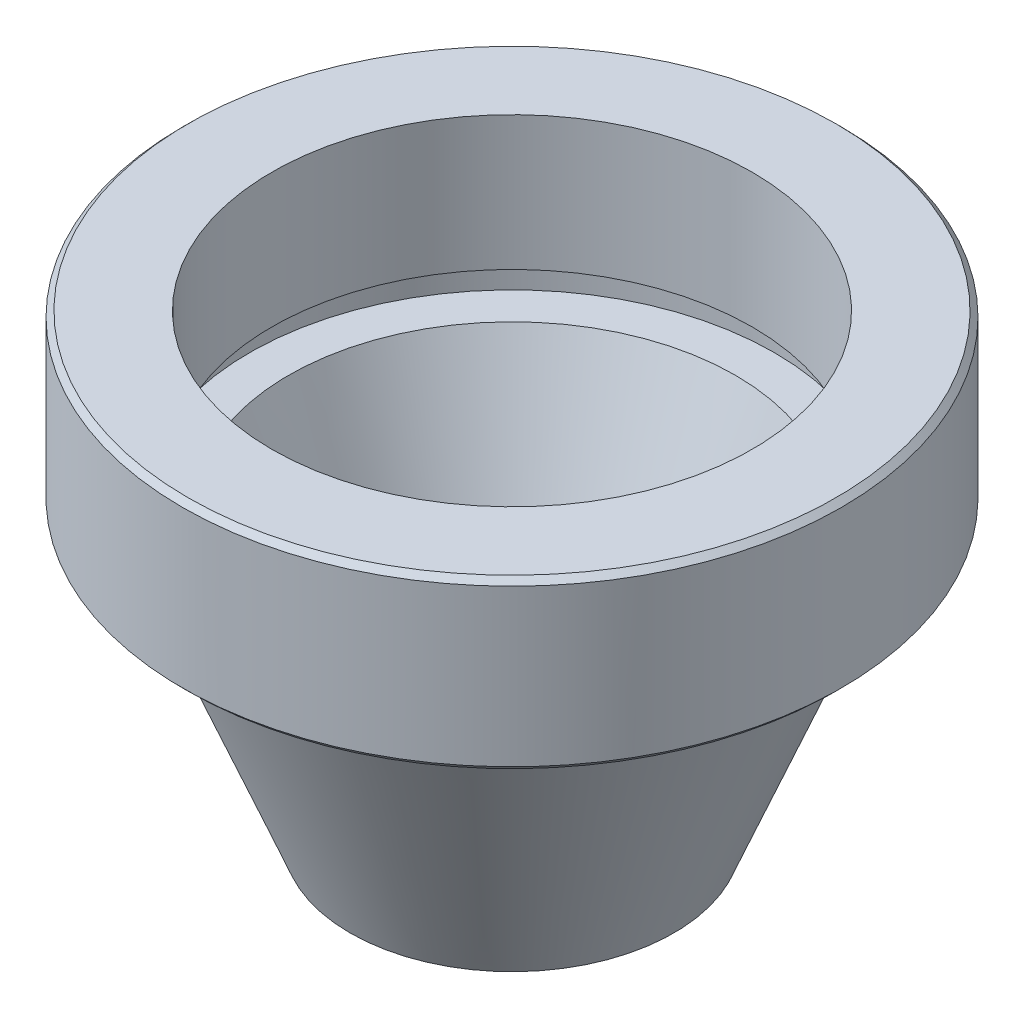
ISO-10303-21;
HEADER;
FILE_DESCRIPTION(('STEP AP214'),'2;1');
FILE_NAME('part.step','',(''),(''),'','','');
FILE_SCHEMA(('AUTOMOTIVE_DESIGN { 1 0 10303 214 1 1 1 1 }'));
ENDSEC;
DATA;
#1=APPLICATION_CONTEXT('core data for automotive mechanical design processes');
#2=APPLICATION_PROTOCOL_DEFINITION('international standard','automotive_design',2000,#1);
#3=PRODUCT_CONTEXT('',#1,'mechanical');
#4=PRODUCT('Part','Part','',(#3));
#5=PRODUCT_RELATED_PRODUCT_CATEGORY('part','',(#4));
#6=PRODUCT_DEFINITION_FORMATION('','',#4);
#7=PRODUCT_DEFINITION_CONTEXT('part definition',#1,'design');
#8=PRODUCT_DEFINITION('design','',#6,#7);
#9=PRODUCT_DEFINITION_SHAPE('','',#8);
#10=(LENGTH_UNIT() NAMED_UNIT(*) SI_UNIT(.MILLI.,.METRE.));
#11=(NAMED_UNIT(*) PLANE_ANGLE_UNIT() SI_UNIT($,.RADIAN.));
#12=(NAMED_UNIT(*) SI_UNIT($,.STERADIAN.) SOLID_ANGLE_UNIT());
#13=UNCERTAINTY_MEASURE_WITH_UNIT(LENGTH_MEASURE(1.E-05),#10,'distance_accuracy_value','');
#14=(GEOMETRIC_REPRESENTATION_CONTEXT(3) GLOBAL_UNCERTAINTY_ASSIGNED_CONTEXT((#13)) GLOBAL_UNIT_ASSIGNED_CONTEXT((#10,
#11,#12)) REPRESENTATION_CONTEXT('',''));
#15=CARTESIAN_POINT('',(0.,0.,0.));
#16=DIRECTION('',(0.,0.,1.));
#17=DIRECTION('',(1.,0.,0.));
#18=AXIS2_PLACEMENT_3D('',#15,#16,#17);
#19=CARTESIAN_POINT('',(0.,23.,-21.5));
#20=DIRECTION('',(0.,-1.,0.));
#21=DIRECTION('',(0.,0.,-1.));
#22=AXIS2_PLACEMENT_3D('',#19,#20,#21);
#23=PLANE('',#22);
#24=CARTESIAN_POINT('',(0.,23.,0.));
#25=DIRECTION('',(0.,-1.,0.));
#26=DIRECTION('',(0.,0.,-1.));
#27=AXIS2_PLACEMENT_3D('',#24,#25,#26);
#28=CIRCLE('',#27,23.5);
#29=CARTESIAN_POINT('',(0.,23.,-23.5));
#30=VERTEX_POINT('',#29);
#31=EDGE_CURVE('E76',#30,#30,#28,.T.);
#32=ORIENTED_EDGE('',*,*,#31,.T.);
#33=EDGE_LOOP('',(#32));
#34=FACE_BOUND('',#33,.T.);
#35=CARTESIAN_POINT('',(0.,23.,0.));
#36=DIRECTION('',(0.,-1.,0.));
#37=DIRECTION('',(0.,0.,-1.));
#38=AXIS2_PLACEMENT_3D('',#35,#36,#37);
#39=CIRCLE('',#38,21.5);
#40=CARTESIAN_POINT('',(0.,23.,-21.5));
#41=VERTEX_POINT('',#40);
#42=EDGE_CURVE('E58',#41,#41,#39,.T.);
#43=ORIENTED_EDGE('',*,*,#42,.F.);
#44=EDGE_LOOP('',(#43));
#45=FACE_BOUND('',#44,.T.);
#46=ADVANCED_FACE('F32',(#34,#45),#23,.T.);
#47=CARTESIAN_POINT('',(0.,0.,0.));
#48=DIRECTION('',(0.,-1.,0.));
#49=DIRECTION('',(0.,0.,-1.));
#50=AXIS2_PLACEMENT_3D('',#47,#48,#49);
#51=CYLINDRICAL_SURFACE('',#50,21.5);
#52=ORIENTED_EDGE('',*,*,#42,.T.);
#53=EDGE_LOOP('',(#52));
#54=FACE_BOUND('',#53,.T.);
#55=CARTESIAN_POINT('',(0.,35.,0.));
#56=DIRECTION('',(0.,-1.,0.));
#57=DIRECTION('',(0.,0.,-1.));
#58=AXIS2_PLACEMENT_3D('',#55,#56,#57);
#59=CIRCLE('',#58,21.5);
#60=CARTESIAN_POINT('',(0.,35.,-21.5));
#61=VERTEX_POINT('',#60);
#62=EDGE_CURVE('E61',#61,#61,#59,.T.);
#63=ORIENTED_EDGE('',*,*,#62,.F.);
#64=EDGE_LOOP('',(#63));
#65=FACE_BOUND('',#64,.T.);
#66=ADVANCED_FACE('F99',(#54,#65),#51,.F.);
#67=CARTESIAN_POINT('',(0.,35.,-29.5));
#68=DIRECTION('',(0.,1.,0.));
#69=DIRECTION('',(0.,0.,1.));
#70=AXIS2_PLACEMENT_3D('',#67,#68,#69);
#71=PLANE('',#70);
#72=CARTESIAN_POINT('',(0.,35.,0.));
#73=DIRECTION('',(0.,1.,0.));
#74=DIRECTION('',(0.,0.,1.));
#75=AXIS2_PLACEMENT_3D('',#72,#73,#74);
#76=CIRCLE('',#75,29.);
#77=CARTESIAN_POINT('',(0.,35.,29.));
#78=VERTEX_POINT('',#77);
#79=EDGE_CURVE('E43',#78,#78,#76,.T.);
#80=ORIENTED_EDGE('',*,*,#79,.T.);
#81=EDGE_LOOP('',(#80));
#82=FACE_BOUND('',#81,.T.);
#83=ORIENTED_EDGE('',*,*,#62,.T.);
#84=EDGE_LOOP('',(#83));
#85=FACE_BOUND('',#84,.T.);
#86=ADVANCED_FACE('F104',(#82,#85),#71,.T.);
#87=CARTESIAN_POINT('',(0.,0.,0.));
#88=DIRECTION('',(0.,-1.,0.));
#89=DIRECTION('',(0.,0.,-1.));
#90=AXIS2_PLACEMENT_3D('',#87,#88,#89);
#91=CYLINDRICAL_SURFACE('',#90,29.5);
#92=CARTESIAN_POINT('',(0.,20.5,0.));
#93=DIRECTION('',(0.,-1.,0.));
#94=DIRECTION('',(0.,0.,-1.));
#95=AXIS2_PLACEMENT_3D('',#92,#93,#94);
#96=CIRCLE('',#95,29.5);
#97=CARTESIAN_POINT('',(0.,20.5,-29.5));
#98=VERTEX_POINT('',#97);
#99=EDGE_CURVE('E47',#98,#98,#96,.F.);
#100=ORIENTED_EDGE('',*,*,#99,.T.);
#101=EDGE_LOOP('',(#100));
#102=FACE_BOUND('',#101,.T.);
#103=CARTESIAN_POINT('',(0.,34.5,0.));
#104=DIRECTION('',(0.,1.,0.));
#105=DIRECTION('',(0.,0.,1.));
#106=AXIS2_PLACEMENT_3D('',#103,#104,#105);
#107=CIRCLE('',#106,29.5);
#108=CARTESIAN_POINT('',(0.,34.5,29.5));
#109=VERTEX_POINT('',#108);
#110=EDGE_CURVE('E52',#109,#109,#107,.F.);
#111=ORIENTED_EDGE('',*,*,#110,.T.);
#112=EDGE_LOOP('',(#111));
#113=FACE_BOUND('',#112,.T.);
#114=ADVANCED_FACE('F118',(#102,#113),#91,.T.);
#115=CARTESIAN_POINT('',(0.,20.,-25.));
#116=DIRECTION('',(0.,-1.,0.));
#117=DIRECTION('',(0.,0.,-1.));
#118=AXIS2_PLACEMENT_3D('',#115,#116,#117);
#119=PLANE('',#118);
#120=CARTESIAN_POINT('',(0.,20.,0.));
#121=DIRECTION('',(0.,-1.,0.));
#122=DIRECTION('',(0.,0.,-1.));
#123=AXIS2_PLACEMENT_3D('',#120,#121,#122);
#124=CIRCLE('',#123,27.0235255505273);
#125=CARTESIAN_POINT('',(0.,20.,-27.0235255505273));
#126=VERTEX_POINT('',#125);
#127=EDGE_CURVE('E10',#126,#126,#124,.F.);
#128=ORIENTED_EDGE('',*,*,#127,.T.);
#129=EDGE_LOOP('',(#128));
#130=FACE_BOUND('',#129,.T.);
#131=CARTESIAN_POINT('',(0.,20.,0.));
#132=DIRECTION('',(0.,-1.,0.));
#133=DIRECTION('',(0.,0.,-1.));
#134=AXIS2_PLACEMENT_3D('',#131,#132,#133);
#135=CIRCLE('',#134,29.);
#136=CARTESIAN_POINT('',(0.,20.,-29.));
#137=VERTEX_POINT('',#136);
#138=EDGE_CURVE('E55',#137,#137,#135,.T.);
#139=ORIENTED_EDGE('',*,*,#138,.T.);
#140=EDGE_LOOP('',(#139));
#141=FACE_BOUND('',#140,.T.);
#142=ADVANCED_FACE('F120',(#130,#141),#119,.T.);
#143=CARTESIAN_POINT('',(0.,-6.,0.));
#144=DIRECTION('',(0.,1.,0.));
#145=DIRECTION('',(0.,0.,1.));
#146=AXIS2_PLACEMENT_3D('',#143,#144,#145);
#147=CONICAL_SURFACE('',#146,14.495318128286,0.38397243543875);
#148=CARTESIAN_POINT('',(0.,18.1238197802477,0.));
#149=DIRECTION('',(0.,1.,0.));
#150=DIRECTION('',(0.,0.,1.));
#151=AXIS2_PLACEMENT_3D('',#148,#149,#150);
#152=CIRCLE('',#151,24.2419739868269);
#153=CARTESIAN_POINT('',(0.,18.1238197802477,24.2419739868269));
#154=VERTEX_POINT('',#153);
#155=EDGE_CURVE('E39',#154,#154,#152,.F.);
#156=ORIENTED_EDGE('',*,*,#155,.T.);
#157=EDGE_LOOP('',(#156));
#158=FACE_BOUND('',#157,.T.);
#159=CARTESIAN_POINT('',(0.,-6.,0.));
#160=DIRECTION('',(0.,-1.,0.));
#161=DIRECTION('',(0.,0.,-1.));
#162=AXIS2_PLACEMENT_3D('',#159,#160,#161);
#163=CIRCLE('',#162,14.495318128286);
#164=CARTESIAN_POINT('',(0.,-6.,-14.495318128286));
#165=VERTEX_POINT('',#164);
#166=EDGE_CURVE('E64',#165,#165,#163,.T.);
#167=ORIENTED_EDGE('',*,*,#166,.F.);
#168=EDGE_LOOP('',(#167));
#169=FACE_BOUND('',#168,.T.);
#170=ADVANCED_FACE('F127',(#158,#169),#147,.T.);
#171=CARTESIAN_POINT('',(0.,-6.,-14.495318128286));
#172=DIRECTION('',(0.,-1.,0.));
#173=DIRECTION('',(0.,0.,-1.));
#174=AXIS2_PLACEMENT_3D('',#171,#172,#173);
#175=PLANE('',#174);
#176=ORIENTED_EDGE('',*,*,#166,.T.);
#177=EDGE_LOOP('',(#176));
#178=FACE_BOUND('',#177,.T.);
#179=CARTESIAN_POINT('',(0.,-6.,0.));
#180=DIRECTION('',(0.,-1.,0.));
#181=DIRECTION('',(0.,0.,-1.));
#182=AXIS2_PLACEMENT_3D('',#179,#180,#181);
#183=CIRCLE('',#182,9.49531812828601);
#184=CARTESIAN_POINT('',(0.,-6.,-9.49531812828601));
#185=VERTEX_POINT('',#184);
#186=EDGE_CURVE('E67',#185,#185,#183,.T.);
#187=ORIENTED_EDGE('',*,*,#186,.F.);
#188=EDGE_LOOP('',(#187));
#189=FACE_BOUND('',#188,.T.);
#190=ADVANCED_FACE('F133',(#178,#189),#175,.T.);
#191=CARTESIAN_POINT('',(0.,20.,0.));
#192=DIRECTION('',(0.,1.,0.));
#193=DIRECTION('',(0.,0.,1.));
#194=AXIS2_PLACEMENT_3D('',#191,#192,#193);
#195=CONICAL_SURFACE('',#194,20.,0.38397243543875);
#196=ORIENTED_EDGE('',*,*,#186,.T.);
#197=EDGE_LOOP('',(#196));
#198=FACE_BOUND('',#197,.T.);
#199=CARTESIAN_POINT('',(0.,20.,0.));
#200=DIRECTION('',(0.,-1.,0.));
#201=DIRECTION('',(0.,0.,-1.));
#202=AXIS2_PLACEMENT_3D('',#199,#200,#201);
#203=CIRCLE('',#202,20.);
#204=CARTESIAN_POINT('',(0.,20.,-20.));
#205=VERTEX_POINT('',#204);
#206=EDGE_CURVE('E70',#205,#205,#203,.T.);
#207=ORIENTED_EDGE('',*,*,#206,.F.);
#208=EDGE_LOOP('',(#207));
#209=FACE_BOUND('',#208,.T.);
#210=ADVANCED_FACE('F95',(#198,#209),#195,.F.);
#211=CARTESIAN_POINT('',(0.,20.,-23.5));
#212=DIRECTION('',(0.,1.,0.));
#213=DIRECTION('',(0.,0.,1.));
#214=AXIS2_PLACEMENT_3D('',#211,#212,#213);
#215=PLANE('',#214);
#216=ORIENTED_EDGE('',*,*,#206,.T.);
#217=EDGE_LOOP('',(#216));
#218=FACE_BOUND('',#217,.T.);
#219=CARTESIAN_POINT('',(0.,20.,0.));
#220=DIRECTION('',(0.,-1.,0.));
#221=DIRECTION('',(0.,0.,-1.));
#222=AXIS2_PLACEMENT_3D('',#219,#220,#221);
#223=CIRCLE('',#222,23.5);
#224=CARTESIAN_POINT('',(0.,20.,-23.5));
#225=VERTEX_POINT('',#224);
#226=EDGE_CURVE('E73',#225,#225,#223,.T.);
#227=ORIENTED_EDGE('',*,*,#226,.F.);
#228=EDGE_LOOP('',(#227));
#229=FACE_BOUND('',#228,.T.);
#230=ADVANCED_FACE('F85',(#218,#229),#215,.T.);
#231=CARTESIAN_POINT('',(0.,0.,0.));
#232=DIRECTION('',(0.,-1.,0.));
#233=DIRECTION('',(0.,0.,-1.));
#234=AXIS2_PLACEMENT_3D('',#231,#232,#233);
#235=CYLINDRICAL_SURFACE('',#234,23.5);
#236=ORIENTED_EDGE('',*,*,#226,.T.);
#237=EDGE_LOOP('',(#236));
#238=FACE_BOUND('',#237,.T.);
#239=ORIENTED_EDGE('',*,*,#31,.F.);
#240=EDGE_LOOP('',(#239));
#241=FACE_BOUND('',#240,.T.);
#242=ADVANCED_FACE('F82',(#238,#241),#235,.F.);
#243=CARTESIAN_POINT('',(0.,20.,0.));
#244=DIRECTION('',(0.,1.,0.));
#245=DIRECTION('',(0.,0.,1.));
#246=AXIS2_PLACEMENT_3D('',#243,#244,#245);
#247=CONICAL_SURFACE('',#246,29.,0.785398163397435);
#248=ORIENTED_EDGE('',*,*,#99,.F.);
#249=EDGE_LOOP('',(#248));
#250=FACE_BOUND('',#249,.T.);
#251=ORIENTED_EDGE('',*,*,#138,.F.);
#252=EDGE_LOOP('',(#251));
#253=FACE_BOUND('',#252,.T.);
#254=ADVANCED_FACE('F84',(#250,#253),#247,.T.);
#255=CARTESIAN_POINT('',(0.,34.5,0.));
#256=DIRECTION('',(0.,-1.,0.));
#257=DIRECTION('',(0.,0.,-1.));
#258=AXIS2_PLACEMENT_3D('',#255,#256,#257);
#259=CONICAL_SURFACE('',#258,29.5,0.785398163397455);
#260=ORIENTED_EDGE('',*,*,#79,.F.);
#261=EDGE_LOOP('',(#260));
#262=FACE_BOUND('',#261,.T.);
#263=ORIENTED_EDGE('',*,*,#110,.F.);
#264=EDGE_LOOP('',(#263));
#265=FACE_BOUND('',#264,.T.);
#266=ADVANCED_FACE('F92',(#262,#265),#259,.T.);
#267=CARTESIAN_POINT('',(0.,17.,0.));
#268=DIRECTION('',(0.,-1.,0.));
#269=DIRECTION('',(0.,0.,-1.));
#270=AXIS2_PLACEMENT_3D('',#267,#268,#269);
#271=TOROIDAL_SURFACE('',#270,27.0235255505273,3.);
#272=ORIENTED_EDGE('',*,*,#127,.F.);
#273=EDGE_LOOP('',(#272));
#274=FACE_BOUND('',#273,.T.);
#275=ORIENTED_EDGE('',*,*,#155,.F.);
#276=EDGE_LOOP('',(#275));
#277=FACE_BOUND('',#276,.T.);
#278=ADVANCED_FACE('F34',(#274,#277),#271,.F.);
#279=CLOSED_SHELL('',(#46,#66,#86,#114,#142,#170,#190,#210,#230,#242,#254,#266,#278));
#280=MANIFOLD_SOLID_BREP('B2',#279);
#281=ADVANCED_BREP_SHAPE_REPRESENTATION('',(#18,#280),#14);
#282=SHAPE_DEFINITION_REPRESENTATION(#9,#281);
ENDSEC;
END-ISO-10303-21;
